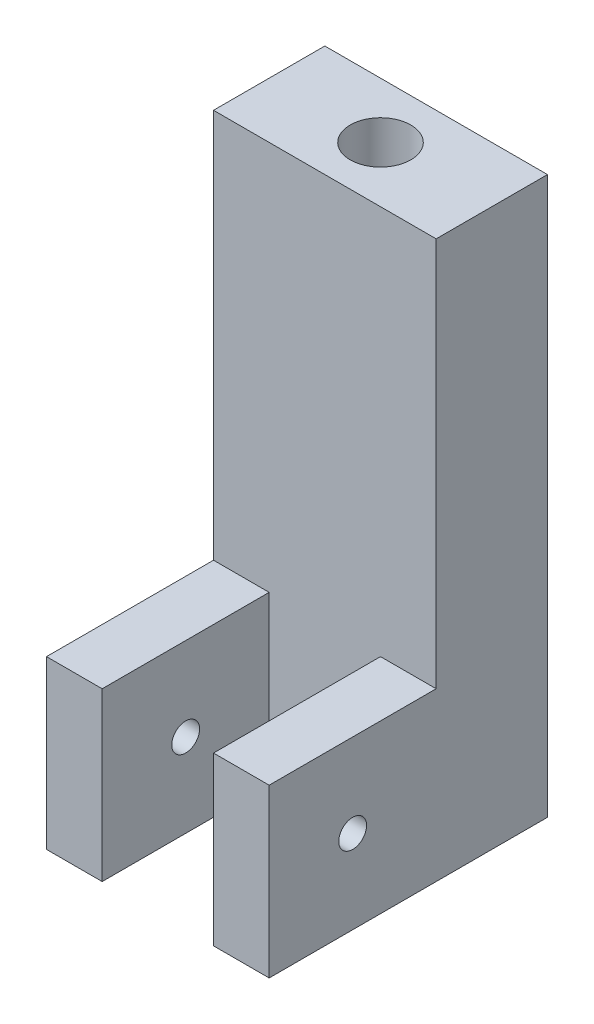
ISO-10303-21;
HEADER;
FILE_DESCRIPTION(('STEP AP214'),'2;1');
FILE_NAME('part.step','',(''),(''),'','','');
FILE_SCHEMA(('AUTOMOTIVE_DESIGN { 1 0 10303 214 1 1 1 1 }'));
ENDSEC;
DATA;
#1=APPLICATION_CONTEXT('core data for automotive mechanical design processes');
#2=APPLICATION_PROTOCOL_DEFINITION('international standard','automotive_design',2000,#1);
#3=PRODUCT_CONTEXT('',#1,'mechanical');
#4=PRODUCT('Part','Part','',(#3));
#5=PRODUCT_RELATED_PRODUCT_CATEGORY('part','',(#4));
#6=PRODUCT_DEFINITION_FORMATION('','',#4);
#7=PRODUCT_DEFINITION_CONTEXT('part definition',#1,'design');
#8=PRODUCT_DEFINITION('design','',#6,#7);
#9=PRODUCT_DEFINITION_SHAPE('','',#8);
#10=(LENGTH_UNIT() NAMED_UNIT(*) SI_UNIT(.MILLI.,.METRE.));
#11=(NAMED_UNIT(*) PLANE_ANGLE_UNIT() SI_UNIT($,.RADIAN.));
#12=(NAMED_UNIT(*) SI_UNIT($,.STERADIAN.) SOLID_ANGLE_UNIT());
#13=UNCERTAINTY_MEASURE_WITH_UNIT(LENGTH_MEASURE(1.E-05),#10,'distance_accuracy_value','');
#14=(GEOMETRIC_REPRESENTATION_CONTEXT(3) GLOBAL_UNCERTAINTY_ASSIGNED_CONTEXT((#13)) GLOBAL_UNIT_ASSIGNED_CONTEXT((#10,
#11,#12)) REPRESENTATION_CONTEXT('',''));
#15=CARTESIAN_POINT('',(0.,0.,0.));
#16=DIRECTION('',(0.,0.,1.));
#17=DIRECTION('',(1.,0.,0.));
#18=AXIS2_PLACEMENT_3D('',#15,#16,#17);
#19=CARTESIAN_POINT('',(25.4,19.05,12.7));
#20=DIRECTION('',(0.,-1.,0.));
#21=DIRECTION('',(0.,0.,-1.));
#22=AXIS2_PLACEMENT_3D('',#19,#20,#21);
#23=PLANE('',#22);
#24=DIRECTION('',(-1.,0.,0.));
#25=VECTOR('',#24,1.);
#26=CARTESIAN_POINT('',(25.4,19.05,31.75));
#27=LINE('',#26,#25);
#28=CARTESIAN_POINT('',(6.35,19.05,31.75));
#29=VERTEX_POINT('',#28);
#30=CARTESIAN_POINT('',(0.,19.05,31.75));
#31=VERTEX_POINT('',#30);
#32=EDGE_CURVE('E160',#29,#31,#27,.T.);
#33=ORIENTED_EDGE('',*,*,#32,.F.);
#34=DIRECTION('',(0.,0.,1.));
#35=VECTOR('',#34,1.);
#36=CARTESIAN_POINT('',(6.35,19.05,12.7));
#37=LINE('',#36,#35);
#38=CARTESIAN_POINT('',(6.35,19.05,12.7));
#39=VERTEX_POINT('',#38);
#40=EDGE_CURVE('E166',#39,#29,#37,.T.);
#41=ORIENTED_EDGE('',*,*,#40,.F.);
#42=DIRECTION('',(-1.,0.,0.));
#43=VECTOR('',#42,1.);
#44=CARTESIAN_POINT('',(25.4,19.05,12.7));
#45=LINE('',#44,#43);
#46=CARTESIAN_POINT('',(0.,19.05,12.7));
#47=VERTEX_POINT('',#46);
#48=EDGE_CURVE('E133',#39,#47,#45,.T.);
#49=ORIENTED_EDGE('',*,*,#48,.T.);
#50=DIRECTION('',(0.,0.,1.));
#51=VECTOR('',#50,1.);
#52=CARTESIAN_POINT('',(0.,19.05,12.7));
#53=LINE('',#52,#51);
#54=EDGE_CURVE('E151',#47,#31,#53,.T.);
#55=ORIENTED_EDGE('',*,*,#54,.T.);
#56=EDGE_LOOP('',(#33,#41,#49,#55));
#57=FACE_BOUND('',#56,.T.);
#58=ADVANCED_FACE('F38',(#57),#23,.F.);
#59=CARTESIAN_POINT('',(25.4,0.,31.75));
#60=DIRECTION('',(0.,0.,-1.));
#61=DIRECTION('',(-1.,0.,0.));
#62=AXIS2_PLACEMENT_3D('',#59,#60,#61);
#63=PLANE('',#62);
#64=DIRECTION('',(-1.,0.,0.));
#65=VECTOR('',#64,1.);
#66=CARTESIAN_POINT('',(25.4,0.,31.75));
#67=LINE('',#66,#65);
#68=CARTESIAN_POINT('',(6.35,0.,31.75));
#69=VERTEX_POINT('',#68);
#70=CARTESIAN_POINT('',(0.,0.,31.75));
#71=VERTEX_POINT('',#70);
#72=EDGE_CURVE('E92',#69,#71,#67,.T.);
#73=ORIENTED_EDGE('',*,*,#72,.F.);
#74=DIRECTION('',(0.,-1.,0.));
#75=VECTOR('',#74,1.);
#76=CARTESIAN_POINT('',(6.35,0.,31.75));
#77=LINE('',#76,#75);
#78=EDGE_CURVE('E228',#29,#69,#77,.T.);
#79=ORIENTED_EDGE('',*,*,#78,.F.);
#80=ORIENTED_EDGE('',*,*,#32,.T.);
#81=DIRECTION('',(0.,-1.,0.));
#82=VECTOR('',#81,1.);
#83=CARTESIAN_POINT('',(0.,0.,31.75));
#84=LINE('',#83,#82);
#85=EDGE_CURVE('E154',#31,#71,#84,.T.);
#86=ORIENTED_EDGE('',*,*,#85,.T.);
#87=EDGE_LOOP('',(#73,#79,#80,#86));
#88=FACE_BOUND('',#87,.T.);
#89=ADVANCED_FACE('F248',(#88),#63,.F.);
#90=CARTESIAN_POINT('',(0.,9.525,22.225));
#91=DIRECTION('',(1.,0.,0.));
#92=DIRECTION('',(0.,0.,-1.));
#93=AXIS2_PLACEMENT_3D('',#90,#91,#92);
#94=CYLINDRICAL_SURFACE('',#93,1.5875);
#95=CARTESIAN_POINT('',(6.35,9.525,22.225));
#96=DIRECTION('',(-1.,0.,0.));
#97=DIRECTION('',(0.,-1.,0.));
#98=AXIS2_PLACEMENT_3D('',#95,#96,#97);
#99=CIRCLE('',#98,1.5875);
#100=CARTESIAN_POINT('',(6.35,7.9375,22.225));
#101=VERTEX_POINT('',#100);
#102=EDGE_CURVE('E42',#101,#101,#99,.F.);
#103=ORIENTED_EDGE('',*,*,#102,.T.);
#104=EDGE_LOOP('',(#103));
#105=FACE_BOUND('',#104,.T.);
#106=CARTESIAN_POINT('',(0.,9.525,22.225));
#107=DIRECTION('',(1.,0.,0.));
#108=DIRECTION('',(0.,0.,-1.));
#109=AXIS2_PLACEMENT_3D('',#106,#107,#108);
#110=CIRCLE('',#109,1.5875);
#111=CARTESIAN_POINT('',(0.,9.525,20.6375));
#112=VERTEX_POINT('',#111);
#113=EDGE_CURVE('E145',#112,#112,#110,.T.);
#114=ORIENTED_EDGE('',*,*,#113,.F.);
#115=EDGE_LOOP('',(#114));
#116=FACE_BOUND('',#115,.T.);
#117=ADVANCED_FACE('F253',(#105,#116),#94,.F.);
#118=CARTESIAN_POINT('',(25.4,0.,0.));
#119=DIRECTION('',(0.,1.,0.));
#120=DIRECTION('',(0.,0.,1.));
#121=AXIS2_PLACEMENT_3D('',#118,#119,#120);
#122=PLANE('',#121);
#123=CARTESIAN_POINT('',(12.7,0.,6.35));
#124=DIRECTION('',(0.,1.,0.));
#125=DIRECTION('',(0.,0.,1.));
#126=AXIS2_PLACEMENT_3D('',#123,#124,#125);
#127=CIRCLE('',#126,3.45439999999999);
#128=CARTESIAN_POINT('',(12.7,0.,9.80439999999999));
#129=VERTEX_POINT('',#128);
#130=EDGE_CURVE('E230',#129,#129,#127,.T.);
#131=ORIENTED_EDGE('',*,*,#130,.T.);
#132=EDGE_LOOP('',(#131));
#133=FACE_BOUND('',#132,.T.);
#134=DIRECTION('',(1.,0.,0.));
#135=VECTOR('',#134,1.);
#136=CARTESIAN_POINT('',(6.35,0.,12.7));
#137=LINE('',#136,#135);
#138=CARTESIAN_POINT('',(6.35,0.,12.7));
#139=VERTEX_POINT('',#138);
#140=CARTESIAN_POINT('',(19.05,0.,12.7));
#141=VERTEX_POINT('',#140);
#142=EDGE_CURVE('E223',#139,#141,#137,.T.);
#143=ORIENTED_EDGE('',*,*,#142,.F.);
#144=DIRECTION('',(0.,0.,1.));
#145=VECTOR('',#144,1.);
#146=CARTESIAN_POINT('',(6.35,0.,12.7));
#147=LINE('',#146,#145);
#148=EDGE_CURVE('E185',#139,#69,#147,.T.);
#149=ORIENTED_EDGE('',*,*,#148,.T.);
#150=ORIENTED_EDGE('',*,*,#72,.T.);
#151=DIRECTION('',(0.,0.,-1.));
#152=VECTOR('',#151,1.);
#153=CARTESIAN_POINT('',(0.,0.,0.));
#154=LINE('',#153,#152);
#155=CARTESIAN_POINT('',(0.,0.,0.));
#156=VERTEX_POINT('',#155);
#157=EDGE_CURVE('E142',#71,#156,#154,.T.);
#158=ORIENTED_EDGE('',*,*,#157,.T.);
#159=DIRECTION('',(-1.,0.,0.));
#160=VECTOR('',#159,1.);
#161=CARTESIAN_POINT('',(25.4,0.,0.));
#162=LINE('',#161,#160);
#163=CARTESIAN_POINT('',(25.4,0.,0.));
#164=VERTEX_POINT('',#163);
#165=EDGE_CURVE('E11',#164,#156,#162,.T.);
#166=ORIENTED_EDGE('',*,*,#165,.F.);
#167=DIRECTION('',(0.,0.,-1.));
#168=VECTOR('',#167,1.);
#169=CARTESIAN_POINT('',(25.4,0.,0.));
#170=LINE('',#169,#168);
#171=CARTESIAN_POINT('',(25.4,0.,31.75));
#172=VERTEX_POINT('',#171);
#173=EDGE_CURVE('E156',#172,#164,#170,.T.);
#174=ORIENTED_EDGE('',*,*,#173,.F.);
#175=CARTESIAN_POINT('',(19.05,0.,31.75));
#176=VERTEX_POINT('',#175);
#177=EDGE_CURVE('E157',#172,#176,#67,.T.);
#178=ORIENTED_EDGE('',*,*,#177,.T.);
#179=DIRECTION('',(0.,0.,1.));
#180=VECTOR('',#179,1.);
#181=CARTESIAN_POINT('',(19.05,0.,12.7));
#182=LINE('',#181,#180);
#183=EDGE_CURVE('E55',#141,#176,#182,.T.);
#184=ORIENTED_EDGE('',*,*,#183,.F.);
#185=EDGE_LOOP('',(#143,#149,#150,#158,#166,#174,#178,#184));
#186=FACE_BOUND('',#185,.T.);
#187=ADVANCED_FACE('F40',(#133,#186),#122,.F.);
#188=CARTESIAN_POINT('',(25.4,0.,0.));
#189=DIRECTION('',(0.,0.,1.));
#190=DIRECTION('',(1.,0.,0.));
#191=AXIS2_PLACEMENT_3D('',#188,#189,#190);
#192=PLANE('',#191);
#193=DIRECTION('',(0.,1.,0.));
#194=VECTOR('',#193,1.);
#195=CARTESIAN_POINT('',(0.,0.,0.));
#196=LINE('',#195,#194);
#197=CARTESIAN_POINT('',(0.,63.5,0.));
#198=VERTEX_POINT('',#197);
#199=EDGE_CURVE('E144',#156,#198,#196,.T.);
#200=ORIENTED_EDGE('',*,*,#199,.T.);
#201=DIRECTION('',(-1.,0.,0.));
#202=VECTOR('',#201,1.);
#203=CARTESIAN_POINT('',(25.4,63.5,0.));
#204=LINE('',#203,#202);
#205=CARTESIAN_POINT('',(25.4,63.5,0.));
#206=VERTEX_POINT('',#205);
#207=EDGE_CURVE('E47',#206,#198,#204,.T.);
#208=ORIENTED_EDGE('',*,*,#207,.F.);
#209=DIRECTION('',(0.,1.,0.));
#210=VECTOR('',#209,1.);
#211=CARTESIAN_POINT('',(25.4,0.,0.));
#212=LINE('',#211,#210);
#213=EDGE_CURVE('E100',#164,#206,#212,.T.);
#214=ORIENTED_EDGE('',*,*,#213,.F.);
#215=ORIENTED_EDGE('',*,*,#165,.T.);
#216=EDGE_LOOP('',(#200,#208,#214,#215));
#217=FACE_BOUND('',#216,.T.);
#218=ADVANCED_FACE('F194',(#217),#192,.F.);
#219=CARTESIAN_POINT('',(25.4,63.5,0.));
#220=DIRECTION('',(0.,-1.,0.));
#221=DIRECTION('',(0.,0.,-1.));
#222=AXIS2_PLACEMENT_3D('',#219,#220,#221);
#223=PLANE('',#222);
#224=CARTESIAN_POINT('',(12.7,63.5,6.35));
#225=DIRECTION('',(0.,1.,0.));
#226=DIRECTION('',(0.,0.,1.));
#227=AXIS2_PLACEMENT_3D('',#224,#225,#226);
#228=CIRCLE('',#227,3.45439999999999);
#229=CARTESIAN_POINT('',(12.7,63.5,9.80439999999999));
#230=VERTEX_POINT('',#229);
#231=EDGE_CURVE('E232',#230,#230,#228,.T.);
#232=ORIENTED_EDGE('',*,*,#231,.F.);
#233=EDGE_LOOP('',(#232));
#234=FACE_BOUND('',#233,.T.);
#235=DIRECTION('',(0.,0.,1.));
#236=VECTOR('',#235,1.);
#237=CARTESIAN_POINT('',(0.,63.5,0.));
#238=LINE('',#237,#236);
#239=CARTESIAN_POINT('',(0.,63.5,12.7));
#240=VERTEX_POINT('',#239);
#241=EDGE_CURVE('E147',#198,#240,#238,.T.);
#242=ORIENTED_EDGE('',*,*,#241,.T.);
#243=DIRECTION('',(-1.,0.,0.));
#244=VECTOR('',#243,1.);
#245=CARTESIAN_POINT('',(25.4,63.5,12.7));
#246=LINE('',#245,#244);
#247=CARTESIAN_POINT('',(25.4,63.5,12.7));
#248=VERTEX_POINT('',#247);
#249=EDGE_CURVE('E132',#248,#240,#246,.T.);
#250=ORIENTED_EDGE('',*,*,#249,.F.);
#251=DIRECTION('',(0.,0.,1.));
#252=VECTOR('',#251,1.);
#253=CARTESIAN_POINT('',(25.4,63.5,0.));
#254=LINE('',#253,#252);
#255=EDGE_CURVE('E117',#206,#248,#254,.T.);
#256=ORIENTED_EDGE('',*,*,#255,.F.);
#257=ORIENTED_EDGE('',*,*,#207,.T.);
#258=EDGE_LOOP('',(#242,#250,#256,#257));
#259=FACE_BOUND('',#258,.T.);
#260=ADVANCED_FACE('F197',(#234,#259),#223,.F.);
#261=CARTESIAN_POINT('',(25.4,19.05,12.7));
#262=DIRECTION('',(0.,0.,-1.));
#263=DIRECTION('',(-1.,0.,0.));
#264=AXIS2_PLACEMENT_3D('',#261,#262,#263);
#265=PLANE('',#264);
#266=DIRECTION('',(0.,-1.,0.));
#267=VECTOR('',#266,1.);
#268=CARTESIAN_POINT('',(0.,19.05,12.7));
#269=LINE('',#268,#267);
#270=EDGE_CURVE('E149',#240,#47,#269,.T.);
#271=ORIENTED_EDGE('',*,*,#270,.T.);
#272=ORIENTED_EDGE('',*,*,#48,.F.);
#273=DIRECTION('',(0.,-1.,0.));
#274=VECTOR('',#273,1.);
#275=CARTESIAN_POINT('',(6.35,0.,12.7));
#276=LINE('',#275,#274);
#277=EDGE_CURVE('E209',#39,#139,#276,.T.);
#278=ORIENTED_EDGE('',*,*,#277,.T.);
#279=ORIENTED_EDGE('',*,*,#142,.T.);
#280=DIRECTION('',(0.,1.,0.));
#281=VECTOR('',#280,1.);
#282=CARTESIAN_POINT('',(19.05,0.,12.7));
#283=LINE('',#282,#281);
#284=CARTESIAN_POINT('',(19.05,19.05,12.7));
#285=VERTEX_POINT('',#284);
#286=EDGE_CURVE('E129',#141,#285,#283,.T.);
#287=ORIENTED_EDGE('',*,*,#286,.T.);
#288=CARTESIAN_POINT('',(25.4,19.05,12.7));
#289=VERTEX_POINT('',#288);
#290=EDGE_CURVE('E124',#289,#285,#45,.T.);
#291=ORIENTED_EDGE('',*,*,#290,.F.);
#292=DIRECTION('',(0.,-1.,0.));
#293=VECTOR('',#292,1.);
#294=CARTESIAN_POINT('',(25.4,19.05,12.7));
#295=LINE('',#294,#293);
#296=EDGE_CURVE('E110',#248,#289,#295,.T.);
#297=ORIENTED_EDGE('',*,*,#296,.F.);
#298=ORIENTED_EDGE('',*,*,#249,.T.);
#299=EDGE_LOOP('',(#271,#272,#278,#279,#287,#291,#297,#298));
#300=FACE_BOUND('',#299,.T.);
#301=ADVANCED_FACE('F126',(#300),#265,.F.);
#302=ORIENTED_EDGE('',*,*,#290,.T.);
#303=DIRECTION('',(0.,0.,1.));
#304=VECTOR('',#303,1.);
#305=CARTESIAN_POINT('',(19.05,19.05,12.7));
#306=LINE('',#305,#304);
#307=CARTESIAN_POINT('',(19.05,19.05,31.75));
#308=VERTEX_POINT('',#307);
#309=EDGE_CURVE('E172',#285,#308,#306,.T.);
#310=ORIENTED_EDGE('',*,*,#309,.T.);
#311=CARTESIAN_POINT('',(25.4,19.05,31.75));
#312=VERTEX_POINT('',#311);
#313=EDGE_CURVE('E137',#312,#308,#27,.T.);
#314=ORIENTED_EDGE('',*,*,#313,.F.);
#315=DIRECTION('',(0.,0.,1.));
#316=VECTOR('',#315,1.);
#317=CARTESIAN_POINT('',(25.4,19.05,12.7));
#318=LINE('',#317,#316);
#319=EDGE_CURVE('E114',#289,#312,#318,.T.);
#320=ORIENTED_EDGE('',*,*,#319,.F.);
#321=EDGE_LOOP('',(#302,#310,#314,#320));
#322=FACE_BOUND('',#321,.T.);
#323=ADVANCED_FACE('F135',(#322),#23,.F.);
#324=ORIENTED_EDGE('',*,*,#313,.T.);
#325=DIRECTION('',(0.,1.,0.));
#326=VECTOR('',#325,1.);
#327=CARTESIAN_POINT('',(19.05,0.,31.75));
#328=LINE('',#327,#326);
#329=EDGE_CURVE('E181',#176,#308,#328,.T.);
#330=ORIENTED_EDGE('',*,*,#329,.F.);
#331=ORIENTED_EDGE('',*,*,#177,.F.);
#332=DIRECTION('',(0.,-1.,0.));
#333=VECTOR('',#332,1.);
#334=CARTESIAN_POINT('',(25.4,0.,31.75));
#335=LINE('',#334,#333);
#336=EDGE_CURVE('E64',#312,#172,#335,.T.);
#337=ORIENTED_EDGE('',*,*,#336,.F.);
#338=EDGE_LOOP('',(#324,#330,#331,#337));
#339=FACE_BOUND('',#338,.T.);
#340=ADVANCED_FACE('F227',(#339),#63,.F.);
#341=CARTESIAN_POINT('',(25.4,0.,0.));
#342=DIRECTION('',(-1.,0.,0.));
#343=DIRECTION('',(0.,0.,1.));
#344=AXIS2_PLACEMENT_3D('',#341,#342,#343);
#345=PLANE('',#344);
#346=CARTESIAN_POINT('',(25.4,9.525,22.225));
#347=DIRECTION('',(1.,0.,0.));
#348=DIRECTION('',(0.,0.,-1.));
#349=AXIS2_PLACEMENT_3D('',#346,#347,#348);
#350=CIRCLE('',#349,1.5875);
#351=CARTESIAN_POINT('',(25.4,9.525,20.6375));
#352=VERTEX_POINT('',#351);
#353=EDGE_CURVE('E170',#352,#352,#350,.T.);
#354=ORIENTED_EDGE('',*,*,#353,.F.);
#355=EDGE_LOOP('',(#354));
#356=FACE_BOUND('',#355,.T.);
#357=ORIENTED_EDGE('',*,*,#173,.T.);
#358=ORIENTED_EDGE('',*,*,#213,.T.);
#359=ORIENTED_EDGE('',*,*,#255,.T.);
#360=ORIENTED_EDGE('',*,*,#296,.T.);
#361=ORIENTED_EDGE('',*,*,#319,.T.);
#362=ORIENTED_EDGE('',*,*,#336,.T.);
#363=EDGE_LOOP('',(#357,#358,#359,#360,#361,#362));
#364=FACE_BOUND('',#363,.T.);
#365=ADVANCED_FACE('F112',(#356,#364),#345,.F.);
#366=CARTESIAN_POINT('',(0.,0.,0.));
#367=DIRECTION('',(-1.,0.,0.));
#368=DIRECTION('',(0.,0.,1.));
#369=AXIS2_PLACEMENT_3D('',#366,#367,#368);
#370=PLANE('',#369);
#371=ORIENTED_EDGE('',*,*,#113,.T.);
#372=EDGE_LOOP('',(#371));
#373=FACE_BOUND('',#372,.T.);
#374=ORIENTED_EDGE('',*,*,#157,.F.);
#375=ORIENTED_EDGE('',*,*,#85,.F.);
#376=ORIENTED_EDGE('',*,*,#54,.F.);
#377=ORIENTED_EDGE('',*,*,#270,.F.);
#378=ORIENTED_EDGE('',*,*,#241,.F.);
#379=ORIENTED_EDGE('',*,*,#199,.F.);
#380=EDGE_LOOP('',(#374,#375,#376,#377,#378,#379));
#381=FACE_BOUND('',#380,.T.);
#382=ADVANCED_FACE('F203',(#373,#381),#370,.T.);
#383=CARTESIAN_POINT('',(19.05,9.525,22.225));
#384=DIRECTION('',(1.,0.,0.));
#385=DIRECTION('',(0.,0.,-1.));
#386=AXIS2_PLACEMENT_3D('',#383,#384,#385);
#387=CIRCLE('',#386,1.5875);
#388=CARTESIAN_POINT('',(19.05,9.525,20.6375));
#389=VERTEX_POINT('',#388);
#390=EDGE_CURVE('E164',#389,#389,#387,.F.);
#391=ORIENTED_EDGE('',*,*,#390,.T.);
#392=EDGE_LOOP('',(#391));
#393=FACE_BOUND('',#392,.T.);
#394=ORIENTED_EDGE('',*,*,#353,.T.);
#395=EDGE_LOOP('',(#394));
#396=FACE_BOUND('',#395,.T.);
#397=ADVANCED_FACE('F267',(#393,#396),#94,.F.);
#398=CARTESIAN_POINT('',(6.35,0.,12.7));
#399=DIRECTION('',(-1.,0.,0.));
#400=DIRECTION('',(0.,-1.,0.));
#401=AXIS2_PLACEMENT_3D('',#398,#399,#400);
#402=PLANE('',#401);
#403=ORIENTED_EDGE('',*,*,#78,.T.);
#404=ORIENTED_EDGE('',*,*,#148,.F.);
#405=ORIENTED_EDGE('',*,*,#277,.F.);
#406=ORIENTED_EDGE('',*,*,#40,.T.);
#407=EDGE_LOOP('',(#403,#404,#405,#406));
#408=FACE_BOUND('',#407,.T.);
#409=ORIENTED_EDGE('',*,*,#102,.F.);
#410=EDGE_LOOP('',(#409));
#411=FACE_BOUND('',#410,.T.);
#412=ADVANCED_FACE('F272',(#408,#411),#402,.F.);
#413=CARTESIAN_POINT('',(19.05,0.,12.7));
#414=DIRECTION('',(1.,0.,0.));
#415=DIRECTION('',(0.,0.,-1.));
#416=AXIS2_PLACEMENT_3D('',#413,#414,#415);
#417=PLANE('',#416);
#418=ORIENTED_EDGE('',*,*,#329,.T.);
#419=ORIENTED_EDGE('',*,*,#309,.F.);
#420=ORIENTED_EDGE('',*,*,#286,.F.);
#421=ORIENTED_EDGE('',*,*,#183,.T.);
#422=EDGE_LOOP('',(#418,#419,#420,#421));
#423=FACE_BOUND('',#422,.T.);
#424=ORIENTED_EDGE('',*,*,#390,.F.);
#425=EDGE_LOOP('',(#424));
#426=FACE_BOUND('',#425,.T.);
#427=ADVANCED_FACE('F221',(#423,#426),#417,.F.);
#428=CARTESIAN_POINT('',(12.7,63.5,6.35));
#429=DIRECTION('',(0.,1.,0.));
#430=DIRECTION('',(0.,0.,1.));
#431=AXIS2_PLACEMENT_3D('',#428,#429,#430);
#432=CYLINDRICAL_SURFACE('',#431,3.45439999999999);
#433=ORIENTED_EDGE('',*,*,#130,.F.);
#434=EDGE_LOOP('',(#433));
#435=FACE_BOUND('',#434,.T.);
#436=ORIENTED_EDGE('',*,*,#231,.T.);
#437=EDGE_LOOP('',(#436));
#438=FACE_BOUND('',#437,.T.);
#439=ADVANCED_FACE('F238',(#435,#438),#432,.F.);
#440=CLOSED_SHELL('',(#58,#89,#117,#187,#218,#260,#301,#323,#340,#365,#382,#397,#412,#427,#439));
#441=MANIFOLD_SOLID_BREP('B2',#440);
#442=ADVANCED_BREP_SHAPE_REPRESENTATION('',(#18,#441),#14);
#443=SHAPE_DEFINITION_REPRESENTATION(#9,#442);
ENDSEC;
END-ISO-10303-21;
